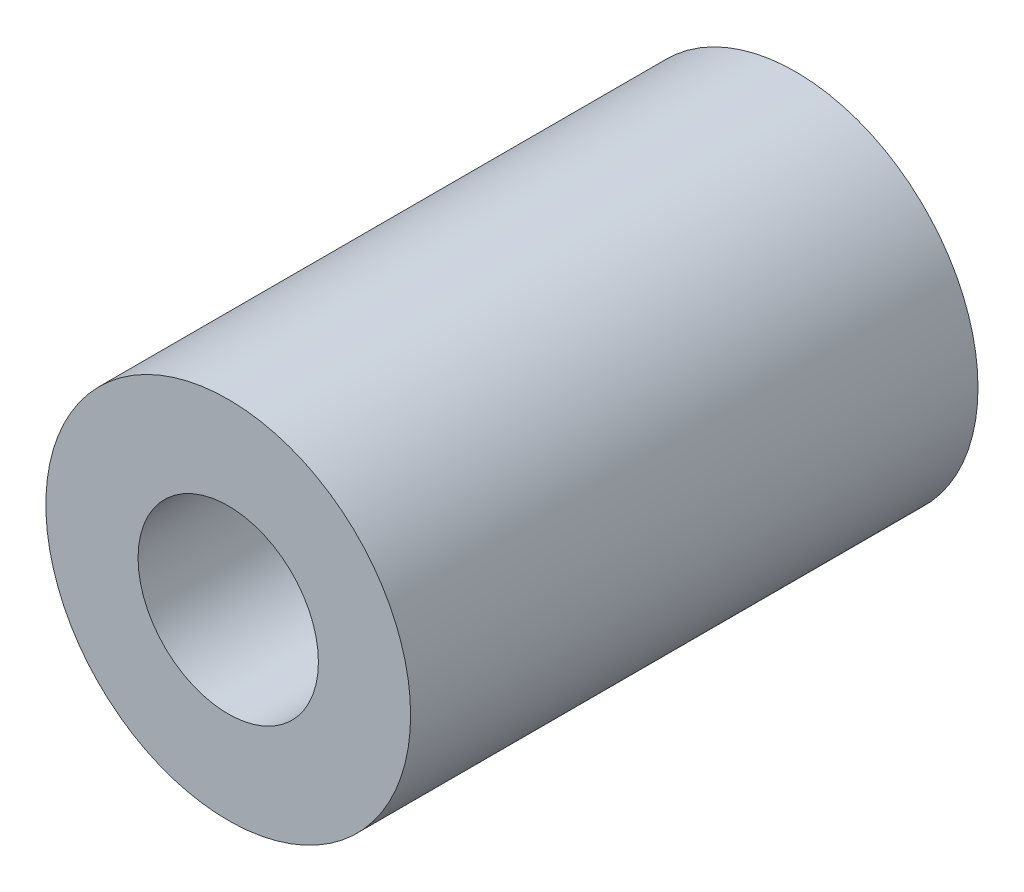
ISO-10303-21;
HEADER;
FILE_DESCRIPTION(('STEP AP214'),'2;1');
FILE_NAME('part.step','',(''),(''),'','','');
FILE_SCHEMA(('AUTOMOTIVE_DESIGN { 1 0 10303 214 1 1 1 1 }'));
ENDSEC;
DATA;
#1=APPLICATION_CONTEXT('core data for automotive mechanical design processes');
#2=APPLICATION_PROTOCOL_DEFINITION('international standard','automotive_design',2000,#1);
#3=PRODUCT_CONTEXT('',#1,'mechanical');
#4=PRODUCT('Part','Part','',(#3));
#5=PRODUCT_RELATED_PRODUCT_CATEGORY('part','',(#4));
#6=PRODUCT_DEFINITION_FORMATION('','',#4);
#7=PRODUCT_DEFINITION_CONTEXT('part definition',#1,'design');
#8=PRODUCT_DEFINITION('design','',#6,#7);
#9=PRODUCT_DEFINITION_SHAPE('','',#8);
#10=(LENGTH_UNIT() NAMED_UNIT(*) SI_UNIT(.MILLI.,.METRE.));
#11=(NAMED_UNIT(*) PLANE_ANGLE_UNIT() SI_UNIT($,.RADIAN.));
#12=(NAMED_UNIT(*) SI_UNIT($,.STERADIAN.) SOLID_ANGLE_UNIT());
#13=UNCERTAINTY_MEASURE_WITH_UNIT(LENGTH_MEASURE(1.E-05),#10,'distance_accuracy_value','');
#14=(GEOMETRIC_REPRESENTATION_CONTEXT(3) GLOBAL_UNCERTAINTY_ASSIGNED_CONTEXT((#13)) GLOBAL_UNIT_ASSIGNED_CONTEXT((#10,
#11,#12)) REPRESENTATION_CONTEXT('',''));
#15=CARTESIAN_POINT('',(0.,0.,0.));
#16=DIRECTION('',(0.,0.,1.));
#17=DIRECTION('',(1.,0.,0.));
#18=AXIS2_PLACEMENT_3D('',#15,#16,#17);
#19=CARTESIAN_POINT('',(0.,0.,0.));
#20=DIRECTION('',(0.,0.,1.));
#21=DIRECTION('',(1.,0.,0.));
#22=AXIS2_PLACEMENT_3D('',#19,#20,#21);
#23=PLANE('',#22);
#24=CARTESIAN_POINT('',(0.,0.,0.));
#25=DIRECTION('',(0.,0.,1.));
#26=DIRECTION('',(1.,0.,0.));
#27=AXIS2_PLACEMENT_3D('',#24,#25,#26);
#28=CIRCLE('',#27,9.);
#29=CARTESIAN_POINT('',(9.,0.,0.));
#30=VERTEX_POINT('',#29);
#31=EDGE_CURVE('E10',#30,#30,#28,.T.);
#32=ORIENTED_EDGE('',*,*,#31,.F.);
#33=EDGE_LOOP('',(#32));
#34=FACE_BOUND('',#33,.T.);
#35=CARTESIAN_POINT('',(0.,0.,0.));
#36=DIRECTION('',(0.,0.,1.));
#37=DIRECTION('',(1.,0.,0.));
#38=AXIS2_PLACEMENT_3D('',#35,#36,#37);
#39=CIRCLE('',#38,5.1);
#40=CARTESIAN_POINT('',(5.1,0.,0.));
#41=VERTEX_POINT('',#40);
#42=EDGE_CURVE('E38',#41,#41,#39,.T.);
#43=ORIENTED_EDGE('',*,*,#42,.T.);
#44=EDGE_LOOP('',(#43));
#45=FACE_BOUND('',#44,.T.);
#46=ADVANCED_FACE('F31',(#34,#45),#23,.F.);
#47=CARTESIAN_POINT('',(0.,0.,16.));
#48=DIRECTION('',(0.,0.,-1.));
#49=DIRECTION('',(-1.,0.,0.));
#50=AXIS2_PLACEMENT_3D('',#47,#48,#49);
#51=CYLINDRICAL_SURFACE('',#50,9.);
#52=ORIENTED_EDGE('',*,*,#31,.T.);
#53=EDGE_LOOP('',(#52));
#54=FACE_BOUND('',#53,.T.);
#55=CARTESIAN_POINT('',(0.,0.,28.));
#56=DIRECTION('',(0.,0.,1.));
#57=DIRECTION('',(1.,0.,0.));
#58=AXIS2_PLACEMENT_3D('',#55,#56,#57);
#59=CIRCLE('',#58,9.);
#60=CARTESIAN_POINT('',(9.,0.,28.));
#61=VERTEX_POINT('',#60);
#62=EDGE_CURVE('E46',#61,#61,#59,.T.);
#63=ORIENTED_EDGE('',*,*,#62,.F.);
#64=EDGE_LOOP('',(#63));
#65=FACE_BOUND('',#64,.T.);
#66=ADVANCED_FACE('F33',(#54,#65),#51,.T.);
#67=CARTESIAN_POINT('',(0.,0.,16.));
#68=DIRECTION('',(0.,0.,-1.));
#69=DIRECTION('',(-1.,0.,0.));
#70=AXIS2_PLACEMENT_3D('',#67,#68,#69);
#71=CYLINDRICAL_SURFACE('',#70,5.1);
#72=CARTESIAN_POINT('',(0.,0.,16.));
#73=DIRECTION('',(0.,0.,1.));
#74=DIRECTION('',(1.,0.,0.));
#75=AXIS2_PLACEMENT_3D('',#72,#73,#74);
#76=CIRCLE('',#75,5.1);
#77=CARTESIAN_POINT('',(5.1,0.,16.));
#78=VERTEX_POINT('',#77);
#79=EDGE_CURVE('E42',#78,#78,#76,.T.);
#80=ORIENTED_EDGE('',*,*,#79,.T.);
#81=EDGE_LOOP('',(#80));
#82=FACE_BOUND('',#81,.T.);
#83=ORIENTED_EDGE('',*,*,#42,.F.);
#84=EDGE_LOOP('',(#83));
#85=FACE_BOUND('',#84,.T.);
#86=ADVANCED_FACE('F74',(#82,#85),#71,.F.);
#87=CARTESIAN_POINT('',(0.,0.,16.));
#88=DIRECTION('',(0.,0.,1.));
#89=DIRECTION('',(1.,0.,0.));
#90=AXIS2_PLACEMENT_3D('',#87,#88,#89);
#91=PLANE('',#90);
#92=ORIENTED_EDGE('',*,*,#79,.F.);
#93=EDGE_LOOP('',(#92));
#94=FACE_BOUND('',#93,.T.);
#95=ADVANCED_FACE('F69',(#94),#91,.F.);
#96=CARTESIAN_POINT('',(0.,0.,28.));
#97=DIRECTION('',(0.,0.,1.));
#98=DIRECTION('',(1.,0.,0.));
#99=AXIS2_PLACEMENT_3D('',#96,#97,#98);
#100=PLANE('',#99);
#101=CARTESIAN_POINT('',(0.,0.,28.));
#102=DIRECTION('',(0.,0.,1.));
#103=DIRECTION('',(1.,0.,0.));
#104=AXIS2_PLACEMENT_3D('',#101,#102,#103);
#105=CIRCLE('',#104,4.45);
#106=CARTESIAN_POINT('',(4.45,0.,28.));
#107=VERTEX_POINT('',#106);
#108=EDGE_CURVE('E52',#107,#107,#105,.T.);
#109=ORIENTED_EDGE('',*,*,#108,.F.);
#110=EDGE_LOOP('',(#109));
#111=FACE_BOUND('',#110,.T.);
#112=ORIENTED_EDGE('',*,*,#62,.T.);
#113=EDGE_LOOP('',(#112));
#114=FACE_BOUND('',#113,.T.);
#115=ADVANCED_FACE('F63',(#111,#114),#100,.T.);
#116=CARTESIAN_POINT('',(0.,0.,20.));
#117=DIRECTION('',(0.,0.,1.));
#118=DIRECTION('',(1.,0.,0.));
#119=AXIS2_PLACEMENT_3D('',#116,#117,#118);
#120=CYLINDRICAL_SURFACE('',#119,4.45);
#121=CARTESIAN_POINT('',(0.,0.,20.));
#122=DIRECTION('',(0.,0.,1.));
#123=DIRECTION('',(1.,0.,0.));
#124=AXIS2_PLACEMENT_3D('',#121,#122,#123);
#125=CIRCLE('',#124,4.45);
#126=CARTESIAN_POINT('',(4.45,0.,20.));
#127=VERTEX_POINT('',#126);
#128=EDGE_CURVE('E51',#127,#127,#125,.T.);
#129=ORIENTED_EDGE('',*,*,#128,.F.);
#130=EDGE_LOOP('',(#129));
#131=FACE_BOUND('',#130,.T.);
#132=ORIENTED_EDGE('',*,*,#108,.T.);
#133=EDGE_LOOP('',(#132));
#134=FACE_BOUND('',#133,.T.);
#135=ADVANCED_FACE('F60',(#131,#134),#120,.F.);
#136=CARTESIAN_POINT('',(0.,0.,20.));
#137=DIRECTION('',(0.,0.,1.));
#138=DIRECTION('',(1.,0.,0.));
#139=AXIS2_PLACEMENT_3D('',#136,#137,#138);
#140=PLANE('',#139);
#141=ORIENTED_EDGE('',*,*,#128,.T.);
#142=EDGE_LOOP('',(#141));
#143=FACE_BOUND('',#142,.T.);
#144=ADVANCED_FACE('F58',(#143),#140,.T.);
#145=CLOSED_SHELL('',(#46,#66,#86,#95,#115,#135,#144));
#146=MANIFOLD_SOLID_BREP('B2',#145);
#147=ADVANCED_BREP_SHAPE_REPRESENTATION('',(#18,#146),#14);
#148=SHAPE_DEFINITION_REPRESENTATION(#9,#147);
ENDSEC;
END-ISO-10303-21;
